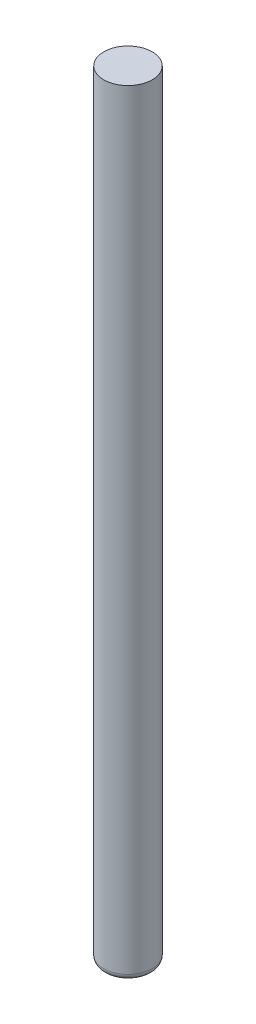
ISO-10303-21;
HEADER;
FILE_DESCRIPTION(('STEP AP214'),'2;1');
FILE_NAME('part.step','',(''),(''),'','','');
FILE_SCHEMA(('AUTOMOTIVE_DESIGN { 1 0 10303 214 1 1 1 1 }'));
ENDSEC;
DATA;
#1=APPLICATION_CONTEXT('core data for automotive mechanical design processes');
#2=APPLICATION_PROTOCOL_DEFINITION('international standard','automotive_design',2000,#1);
#3=PRODUCT_CONTEXT('',#1,'mechanical');
#4=PRODUCT('Part','Part','',(#3));
#5=PRODUCT_RELATED_PRODUCT_CATEGORY('part','',(#4));
#6=PRODUCT_DEFINITION_FORMATION('','',#4);
#7=PRODUCT_DEFINITION_CONTEXT('part definition',#1,'design');
#8=PRODUCT_DEFINITION('design','',#6,#7);
#9=PRODUCT_DEFINITION_SHAPE('','',#8);
#10=(LENGTH_UNIT() NAMED_UNIT(*) SI_UNIT(.MILLI.,.METRE.));
#11=(NAMED_UNIT(*) PLANE_ANGLE_UNIT() SI_UNIT($,.RADIAN.));
#12=(NAMED_UNIT(*) SI_UNIT($,.STERADIAN.) SOLID_ANGLE_UNIT());
#13=UNCERTAINTY_MEASURE_WITH_UNIT(LENGTH_MEASURE(1.E-05),#10,'distance_accuracy_value','');
#14=(GEOMETRIC_REPRESENTATION_CONTEXT(3) GLOBAL_UNCERTAINTY_ASSIGNED_CONTEXT((#13)) GLOBAL_UNIT_ASSIGNED_CONTEXT((#10,
#11,#12)) REPRESENTATION_CONTEXT('',''));
#15=CARTESIAN_POINT('',(0.,0.,0.));
#16=DIRECTION('',(0.,0.,1.));
#17=DIRECTION('',(1.,0.,0.));
#18=AXIS2_PLACEMENT_3D('',#15,#16,#17);
#19=CARTESIAN_POINT('',(0.,64.,0.));
#20=DIRECTION('',(0.,-1.,0.));
#21=DIRECTION('',(0.,0.,-1.));
#22=AXIS2_PLACEMENT_3D('',#19,#20,#21);
#23=CYLINDRICAL_SURFACE('',#22,2.);
#24=CARTESIAN_POINT('',(0.,0.5,0.));
#25=DIRECTION('',(0.,1.,0.));
#26=DIRECTION('',(0.,0.,1.));
#27=AXIS2_PLACEMENT_3D('',#24,#25,#26);
#28=CIRCLE('',#27,2.);
#29=CARTESIAN_POINT('',(0.,0.5,2.));
#30=VERTEX_POINT('',#29);
#31=EDGE_CURVE('E51',#30,#30,#28,.T.);
#32=ORIENTED_EDGE('',*,*,#31,.T.);
#33=EDGE_LOOP('',(#32));
#34=FACE_BOUND('',#33,.T.);
#35=CARTESIAN_POINT('',(0.,64.,0.));
#36=DIRECTION('',(0.,1.,0.));
#37=DIRECTION('',(0.,0.,1.));
#38=AXIS2_PLACEMENT_3D('',#35,#36,#37);
#39=CIRCLE('',#38,2.);
#40=CARTESIAN_POINT('',(0.,64.,2.));
#41=VERTEX_POINT('',#40);
#42=EDGE_CURVE('E56',#41,#41,#39,.T.);
#43=ORIENTED_EDGE('',*,*,#42,.F.);
#44=EDGE_LOOP('',(#43));
#45=FACE_BOUND('',#44,.T.);
#46=ADVANCED_FACE('F43',(#34,#45),#23,.T.);
#47=CARTESIAN_POINT('',(0.,64.,0.));
#48=DIRECTION('',(0.,1.,0.));
#49=DIRECTION('',(0.,0.,1.));
#50=AXIS2_PLACEMENT_3D('',#47,#48,#49);
#51=PLANE('',#50);
#52=ORIENTED_EDGE('',*,*,#42,.T.);
#53=EDGE_LOOP('',(#52));
#54=FACE_BOUND('',#53,.T.);
#55=ADVANCED_FACE('F64',(#54),#51,.T.);
#56=CARTESIAN_POINT('',(0.,0.,0.));
#57=DIRECTION('',(0.,1.,0.));
#58=DIRECTION('',(0.,0.,1.));
#59=AXIS2_PLACEMENT_3D('',#56,#57,#58);
#60=PLANE('',#59);
#61=CARTESIAN_POINT('',(0.,0.,0.));
#62=DIRECTION('',(0.,1.,0.));
#63=DIRECTION('',(0.,0.,1.));
#64=AXIS2_PLACEMENT_3D('',#61,#62,#63);
#65=CIRCLE('',#64,1.5);
#66=CARTESIAN_POINT('',(0.,0.,1.5));
#67=VERTEX_POINT('',#66);
#68=EDGE_CURVE('E10',#67,#67,#65,.F.);
#69=ORIENTED_EDGE('',*,*,#68,.T.);
#70=EDGE_LOOP('',(#69));
#71=FACE_BOUND('',#70,.T.);
#72=ADVANCED_FACE('F71',(#71),#60,.F.);
#73=CARTESIAN_POINT('',(0.,0.5,0.));
#74=DIRECTION('',(0.,1.,0.));
#75=DIRECTION('',(0.,0.,1.));
#76=AXIS2_PLACEMENT_3D('',#73,#74,#75);
#77=TOROIDAL_SURFACE('',#76,1.5,0.5);
#78=ORIENTED_EDGE('',*,*,#68,.F.);
#79=EDGE_LOOP('',(#78));
#80=FACE_BOUND('',#79,.T.);
#81=ORIENTED_EDGE('',*,*,#31,.F.);
#82=EDGE_LOOP('',(#81));
#83=FACE_BOUND('',#82,.T.);
#84=ADVANCED_FACE('F45',(#80,#83),#77,.T.);
#85=CLOSED_SHELL('',(#46,#55,#72,#84));
#86=MANIFOLD_SOLID_BREP('B2',#85);
#87=ADVANCED_BREP_SHAPE_REPRESENTATION('',(#18,#86),#14);
#88=SHAPE_DEFINITION_REPRESENTATION(#9,#87);
ENDSEC;
END-ISO-10303-21;
